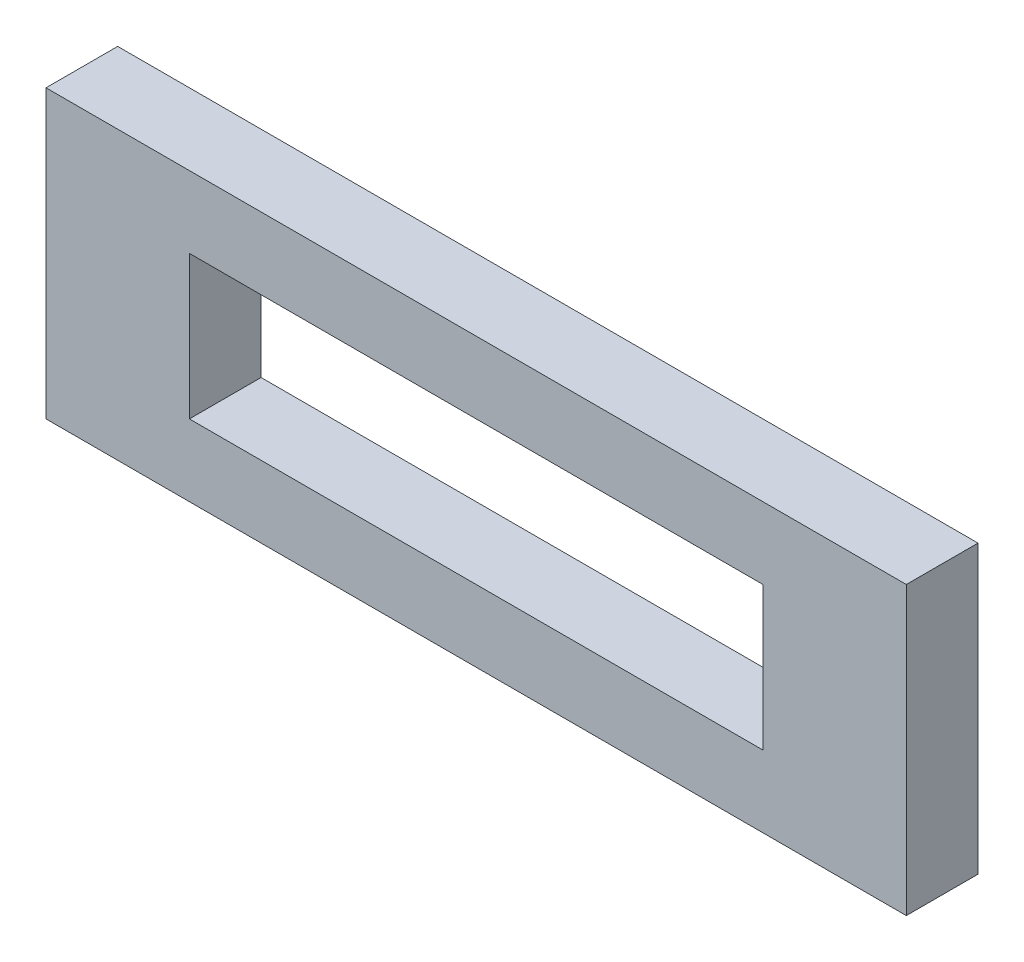
ISO-10303-21;
HEADER;
FILE_DESCRIPTION(('STEP AP214'),'2;1');
FILE_NAME('part.step','',(''),(''),'','','');
FILE_SCHEMA(('AUTOMOTIVE_DESIGN { 1 0 10303 214 1 1 1 1 }'));
ENDSEC;
DATA;
#1=APPLICATION_CONTEXT('core data for automotive mechanical design processes');
#2=APPLICATION_PROTOCOL_DEFINITION('international standard','automotive_design',2000,#1);
#3=PRODUCT_CONTEXT('',#1,'mechanical');
#4=PRODUCT('Part','Part','',(#3));
#5=PRODUCT_RELATED_PRODUCT_CATEGORY('part','',(#4));
#6=PRODUCT_DEFINITION_FORMATION('','',#4);
#7=PRODUCT_DEFINITION_CONTEXT('part definition',#1,'design');
#8=PRODUCT_DEFINITION('design','',#6,#7);
#9=PRODUCT_DEFINITION_SHAPE('','',#8);
#10=(LENGTH_UNIT() NAMED_UNIT(*) SI_UNIT(.MILLI.,.METRE.));
#11=(NAMED_UNIT(*) PLANE_ANGLE_UNIT() SI_UNIT($,.RADIAN.));
#12=(NAMED_UNIT(*) SI_UNIT($,.STERADIAN.) SOLID_ANGLE_UNIT());
#13=UNCERTAINTY_MEASURE_WITH_UNIT(LENGTH_MEASURE(1.E-05),#10,'distance_accuracy_value','');
#14=(GEOMETRIC_REPRESENTATION_CONTEXT(3) GLOBAL_UNCERTAINTY_ASSIGNED_CONTEXT((#13)) GLOBAL_UNIT_ASSIGNED_CONTEXT((#10,
#11,#12)) REPRESENTATION_CONTEXT('',''));
#15=CARTESIAN_POINT('',(0.,0.,0.));
#16=DIRECTION('',(0.,0.,1.));
#17=DIRECTION('',(1.,0.,0.));
#18=AXIS2_PLACEMENT_3D('',#15,#16,#17);
#19=CARTESIAN_POINT('',(-19.05,-6.35,3.175));
#20=DIRECTION('',(0.,0.,1.));
#21=DIRECTION('',(1.,0.,0.));
#22=AXIS2_PLACEMENT_3D('',#19,#20,#21);
#23=PLANE('',#22);
#24=DIRECTION('',(0.,-1.,0.));
#25=VECTOR('',#24,1.);
#26=CARTESIAN_POINT('',(-19.05,6.35,3.175));
#27=LINE('',#26,#25);
#28=CARTESIAN_POINT('',(-19.05,6.35,3.175));
#29=VERTEX_POINT('',#28);
#30=CARTESIAN_POINT('',(-19.05,-6.35,3.175));
#31=VERTEX_POINT('',#30);
#32=EDGE_CURVE('E133',#29,#31,#27,.T.);
#33=ORIENTED_EDGE('',*,*,#32,.T.);
#34=DIRECTION('',(1.,0.,0.));
#35=VECTOR('',#34,1.);
#36=CARTESIAN_POINT('',(-19.05,-6.35,3.175));
#37=LINE('',#36,#35);
#38=CARTESIAN_POINT('',(19.05,-6.35,3.175));
#39=VERTEX_POINT('',#38);
#40=EDGE_CURVE('E136',#31,#39,#37,.T.);
#41=ORIENTED_EDGE('',*,*,#40,.T.);
#42=DIRECTION('',(0.,1.,0.));
#43=VECTOR('',#42,1.);
#44=CARTESIAN_POINT('',(19.05,6.35,3.175));
#45=LINE('',#44,#43);
#46=CARTESIAN_POINT('',(19.05,6.35,3.175));
#47=VERTEX_POINT('',#46);
#48=EDGE_CURVE('E139',#39,#47,#45,.T.);
#49=ORIENTED_EDGE('',*,*,#48,.T.);
#50=DIRECTION('',(-1.,0.,0.));
#51=VECTOR('',#50,1.);
#52=CARTESIAN_POINT('',(-19.05,6.35,3.175));
#53=LINE('',#52,#51);
#54=EDGE_CURVE('E141',#47,#29,#53,.T.);
#55=ORIENTED_EDGE('',*,*,#54,.T.);
#56=EDGE_LOOP('',(#33,#41,#49,#55));
#57=FACE_BOUND('',#56,.T.);
#58=DIRECTION('',(1.,0.,0.));
#59=VECTOR('',#58,1.);
#60=CARTESIAN_POINT('',(-12.7,-3.175,3.175));
#61=LINE('',#60,#59);
#62=CARTESIAN_POINT('',(-12.7,-3.175,3.175));
#63=VERTEX_POINT('',#62);
#64=CARTESIAN_POINT('',(12.7,-3.175,3.175));
#65=VERTEX_POINT('',#64);
#66=EDGE_CURVE('E105',#63,#65,#61,.T.);
#67=ORIENTED_EDGE('',*,*,#66,.F.);
#68=DIRECTION('',(0.,-1.,0.));
#69=VECTOR('',#68,1.);
#70=CARTESIAN_POINT('',(-12.7,3.175,3.175));
#71=LINE('',#70,#69);
#72=CARTESIAN_POINT('',(-12.7,3.175,3.175));
#73=VERTEX_POINT('',#72);
#74=EDGE_CURVE('E97',#73,#63,#71,.T.);
#75=ORIENTED_EDGE('',*,*,#74,.F.);
#76=DIRECTION('',(-1.,0.,0.));
#77=VECTOR('',#76,1.);
#78=CARTESIAN_POINT('',(-12.7,3.175,3.175));
#79=LINE('',#78,#77);
#80=CARTESIAN_POINT('',(12.7,3.175,3.175));
#81=VERTEX_POINT('',#80);
#82=EDGE_CURVE('E119',#81,#73,#79,.T.);
#83=ORIENTED_EDGE('',*,*,#82,.F.);
#84=DIRECTION('',(0.,1.,0.));
#85=VECTOR('',#84,1.);
#86=CARTESIAN_POINT('',(12.7,3.175,3.175));
#87=LINE('',#86,#85);
#88=EDGE_CURVE('E117',#65,#81,#87,.T.);
#89=ORIENTED_EDGE('',*,*,#88,.F.);
#90=EDGE_LOOP('',(#67,#75,#83,#89));
#91=FACE_BOUND('',#90,.T.);
#92=ADVANCED_FACE('F32',(#57,#91),#23,.T.);
#93=CARTESIAN_POINT('',(-19.05,-6.35,0.));
#94=DIRECTION('',(0.,0.,1.));
#95=DIRECTION('',(1.,0.,0.));
#96=AXIS2_PLACEMENT_3D('',#93,#94,#95);
#97=PLANE('',#96);
#98=DIRECTION('',(0.,-1.,0.));
#99=VECTOR('',#98,1.);
#100=CARTESIAN_POINT('',(-19.05,6.35,0.));
#101=LINE('',#100,#99);
#102=CARTESIAN_POINT('',(-19.05,6.35,0.));
#103=VERTEX_POINT('',#102);
#104=CARTESIAN_POINT('',(-19.05,-6.35,0.));
#105=VERTEX_POINT('',#104);
#106=EDGE_CURVE('E113',#103,#105,#101,.T.);
#107=ORIENTED_EDGE('',*,*,#106,.F.);
#108=DIRECTION('',(-1.,0.,0.));
#109=VECTOR('',#108,1.);
#110=CARTESIAN_POINT('',(-19.05,6.35,0.));
#111=LINE('',#110,#109);
#112=CARTESIAN_POINT('',(19.05,6.35,0.));
#113=VERTEX_POINT('',#112);
#114=EDGE_CURVE('E137',#113,#103,#111,.T.);
#115=ORIENTED_EDGE('',*,*,#114,.F.);
#116=DIRECTION('',(0.,1.,0.));
#117=VECTOR('',#116,1.);
#118=CARTESIAN_POINT('',(19.05,6.35,0.));
#119=LINE('',#118,#117);
#120=CARTESIAN_POINT('',(19.05,-6.35,0.));
#121=VERTEX_POINT('',#120);
#122=EDGE_CURVE('E148',#121,#113,#119,.T.);
#123=ORIENTED_EDGE('',*,*,#122,.F.);
#124=DIRECTION('',(1.,0.,0.));
#125=VECTOR('',#124,1.);
#126=CARTESIAN_POINT('',(-19.05,-6.35,0.));
#127=LINE('',#126,#125);
#128=EDGE_CURVE('E146',#105,#121,#127,.T.);
#129=ORIENTED_EDGE('',*,*,#128,.F.);
#130=EDGE_LOOP('',(#107,#115,#123,#129));
#131=FACE_BOUND('',#130,.T.);
#132=DIRECTION('',(0.,-1.,0.));
#133=VECTOR('',#132,1.);
#134=CARTESIAN_POINT('',(-12.7,3.175,0.));
#135=LINE('',#134,#133);
#136=CARTESIAN_POINT('',(-12.7,3.175,0.));
#137=VERTEX_POINT('',#136);
#138=CARTESIAN_POINT('',(-12.7,-3.175,0.));
#139=VERTEX_POINT('',#138);
#140=EDGE_CURVE('E55',#137,#139,#135,.T.);
#141=ORIENTED_EDGE('',*,*,#140,.T.);
#142=DIRECTION('',(1.,0.,0.));
#143=VECTOR('',#142,1.);
#144=CARTESIAN_POINT('',(-12.7,-3.175,0.));
#145=LINE('',#144,#143);
#146=CARTESIAN_POINT('',(12.7,-3.175,0.));
#147=VERTEX_POINT('',#146);
#148=EDGE_CURVE('E112',#139,#147,#145,.T.);
#149=ORIENTED_EDGE('',*,*,#148,.T.);
#150=DIRECTION('',(0.,1.,0.));
#151=VECTOR('',#150,1.);
#152=CARTESIAN_POINT('',(12.7,3.175,0.));
#153=LINE('',#152,#151);
#154=CARTESIAN_POINT('',(12.7,3.175,0.));
#155=VERTEX_POINT('',#154);
#156=EDGE_CURVE('E125',#147,#155,#153,.T.);
#157=ORIENTED_EDGE('',*,*,#156,.T.);
#158=DIRECTION('',(-1.,0.,0.));
#159=VECTOR('',#158,1.);
#160=CARTESIAN_POINT('',(-12.7,3.175,0.));
#161=LINE('',#160,#159);
#162=EDGE_CURVE('E106',#155,#137,#161,.T.);
#163=ORIENTED_EDGE('',*,*,#162,.T.);
#164=EDGE_LOOP('',(#141,#149,#157,#163));
#165=FACE_BOUND('',#164,.T.);
#166=ADVANCED_FACE('F166',(#131,#165),#97,.F.);
#167=CARTESIAN_POINT('',(-19.05,6.35,3.175));
#168=DIRECTION('',(1.,0.,0.));
#169=DIRECTION('',(0.,0.,-1.));
#170=AXIS2_PLACEMENT_3D('',#167,#168,#169);
#171=PLANE('',#170);
#172=ORIENTED_EDGE('',*,*,#106,.T.);
#173=DIRECTION('',(0.,0.,-1.));
#174=VECTOR('',#173,1.);
#175=CARTESIAN_POINT('',(-19.05,-6.35,3.175));
#176=LINE('',#175,#174);
#177=EDGE_CURVE('E11',#31,#105,#176,.T.);
#178=ORIENTED_EDGE('',*,*,#177,.F.);
#179=ORIENTED_EDGE('',*,*,#32,.F.);
#180=DIRECTION('',(0.,0.,-1.));
#181=VECTOR('',#180,1.);
#182=CARTESIAN_POINT('',(-19.05,6.35,3.175));
#183=LINE('',#182,#181);
#184=EDGE_CURVE('E143',#29,#103,#183,.T.);
#185=ORIENTED_EDGE('',*,*,#184,.T.);
#186=EDGE_LOOP('',(#172,#178,#179,#185));
#187=FACE_BOUND('',#186,.T.);
#188=ADVANCED_FACE('F34',(#187),#171,.F.);
#189=CARTESIAN_POINT('',(-19.05,-6.35,3.175));
#190=DIRECTION('',(0.,1.,0.));
#191=DIRECTION('',(0.,0.,1.));
#192=AXIS2_PLACEMENT_3D('',#189,#190,#191);
#193=PLANE('',#192);
#194=ORIENTED_EDGE('',*,*,#128,.T.);
#195=DIRECTION('',(0.,0.,-1.));
#196=VECTOR('',#195,1.);
#197=CARTESIAN_POINT('',(19.05,-6.35,3.175));
#198=LINE('',#197,#196);
#199=EDGE_CURVE('E40',#39,#121,#198,.T.);
#200=ORIENTED_EDGE('',*,*,#199,.F.);
#201=ORIENTED_EDGE('',*,*,#40,.F.);
#202=ORIENTED_EDGE('',*,*,#177,.T.);
#203=EDGE_LOOP('',(#194,#200,#201,#202));
#204=FACE_BOUND('',#203,.T.);
#205=ADVANCED_FACE('F176',(#204),#193,.F.);
#206=CARTESIAN_POINT('',(19.05,6.35,3.175));
#207=DIRECTION('',(-1.,0.,0.));
#208=DIRECTION('',(0.,-1.,0.));
#209=AXIS2_PLACEMENT_3D('',#206,#207,#208);
#210=PLANE('',#209);
#211=ORIENTED_EDGE('',*,*,#122,.T.);
#212=DIRECTION('',(0.,0.,-1.));
#213=VECTOR('',#212,1.);
#214=CARTESIAN_POINT('',(19.05,6.35,3.175));
#215=LINE('',#214,#213);
#216=EDGE_CURVE('E153',#47,#113,#215,.T.);
#217=ORIENTED_EDGE('',*,*,#216,.F.);
#218=ORIENTED_EDGE('',*,*,#48,.F.);
#219=ORIENTED_EDGE('',*,*,#199,.T.);
#220=EDGE_LOOP('',(#211,#217,#218,#219));
#221=FACE_BOUND('',#220,.T.);
#222=ADVANCED_FACE('F160',(#221),#210,.F.);
#223=CARTESIAN_POINT('',(-19.05,6.35,3.175));
#224=DIRECTION('',(0.,-1.,0.));
#225=DIRECTION('',(1.,0.,0.));
#226=AXIS2_PLACEMENT_3D('',#223,#224,#225);
#227=PLANE('',#226);
#228=ORIENTED_EDGE('',*,*,#114,.T.);
#229=ORIENTED_EDGE('',*,*,#184,.F.);
#230=ORIENTED_EDGE('',*,*,#54,.F.);
#231=ORIENTED_EDGE('',*,*,#216,.T.);
#232=EDGE_LOOP('',(#228,#229,#230,#231));
#233=FACE_BOUND('',#232,.T.);
#234=ADVANCED_FACE('F170',(#233),#227,.F.);
#235=CARTESIAN_POINT('',(-12.7,3.175,3.175));
#236=DIRECTION('',(1.,0.,0.));
#237=DIRECTION('',(0.,0.,-1.));
#238=AXIS2_PLACEMENT_3D('',#235,#236,#237);
#239=PLANE('',#238);
#240=ORIENTED_EDGE('',*,*,#140,.F.);
#241=DIRECTION('',(0.,0.,-1.));
#242=VECTOR('',#241,1.);
#243=CARTESIAN_POINT('',(-12.7,3.175,3.175));
#244=LINE('',#243,#242);
#245=EDGE_CURVE('E101',#73,#137,#244,.T.);
#246=ORIENTED_EDGE('',*,*,#245,.F.);
#247=ORIENTED_EDGE('',*,*,#74,.T.);
#248=DIRECTION('',(0.,0.,-1.));
#249=VECTOR('',#248,1.);
#250=CARTESIAN_POINT('',(-12.7,-3.175,3.175));
#251=LINE('',#250,#249);
#252=EDGE_CURVE('E100',#63,#139,#251,.T.);
#253=ORIENTED_EDGE('',*,*,#252,.T.);
#254=EDGE_LOOP('',(#240,#246,#247,#253));
#255=FACE_BOUND('',#254,.T.);
#256=ADVANCED_FACE('F99',(#255),#239,.T.);
#257=CARTESIAN_POINT('',(-12.7,-3.175,3.175));
#258=DIRECTION('',(0.,1.,0.));
#259=DIRECTION('',(0.,0.,1.));
#260=AXIS2_PLACEMENT_3D('',#257,#258,#259);
#261=PLANE('',#260);
#262=ORIENTED_EDGE('',*,*,#148,.F.);
#263=ORIENTED_EDGE('',*,*,#252,.F.);
#264=ORIENTED_EDGE('',*,*,#66,.T.);
#265=DIRECTION('',(0.,0.,-1.));
#266=VECTOR('',#265,1.);
#267=CARTESIAN_POINT('',(12.7,-3.175,3.175));
#268=LINE('',#267,#266);
#269=EDGE_CURVE('E114',#65,#147,#268,.T.);
#270=ORIENTED_EDGE('',*,*,#269,.T.);
#271=EDGE_LOOP('',(#262,#263,#264,#270));
#272=FACE_BOUND('',#271,.T.);
#273=ADVANCED_FACE('F109',(#272),#261,.T.);
#274=CARTESIAN_POINT('',(12.7,3.175,3.175));
#275=DIRECTION('',(-1.,0.,0.));
#276=DIRECTION('',(0.,0.,1.));
#277=AXIS2_PLACEMENT_3D('',#274,#275,#276);
#278=PLANE('',#277);
#279=ORIENTED_EDGE('',*,*,#156,.F.);
#280=ORIENTED_EDGE('',*,*,#269,.F.);
#281=ORIENTED_EDGE('',*,*,#88,.T.);
#282=DIRECTION('',(0.,0.,-1.));
#283=VECTOR('',#282,1.);
#284=CARTESIAN_POINT('',(12.7,3.175,3.175));
#285=LINE('',#284,#283);
#286=EDGE_CURVE('E47',#81,#155,#285,.T.);
#287=ORIENTED_EDGE('',*,*,#286,.T.);
#288=EDGE_LOOP('',(#279,#280,#281,#287));
#289=FACE_BOUND('',#288,.T.);
#290=ADVANCED_FACE('F199',(#289),#278,.T.);
#291=CARTESIAN_POINT('',(-12.7,3.175,3.175));
#292=DIRECTION('',(0.,-1.,0.));
#293=DIRECTION('',(0.,0.,-1.));
#294=AXIS2_PLACEMENT_3D('',#291,#292,#293);
#295=PLANE('',#294);
#296=ORIENTED_EDGE('',*,*,#162,.F.);
#297=ORIENTED_EDGE('',*,*,#286,.F.);
#298=ORIENTED_EDGE('',*,*,#82,.T.);
#299=ORIENTED_EDGE('',*,*,#245,.T.);
#300=EDGE_LOOP('',(#296,#297,#298,#299));
#301=FACE_BOUND('',#300,.T.);
#302=ADVANCED_FACE('F203',(#301),#295,.T.);
#303=CLOSED_SHELL('',(#92,#166,#188,#205,#222,#234,#256,#273,#290,#302));
#304=MANIFOLD_SOLID_BREP('B2',#303);
#305=ADVANCED_BREP_SHAPE_REPRESENTATION('',(#18,#304),#14);
#306=SHAPE_DEFINITION_REPRESENTATION(#9,#305);
ENDSEC;
END-ISO-10303-21;
